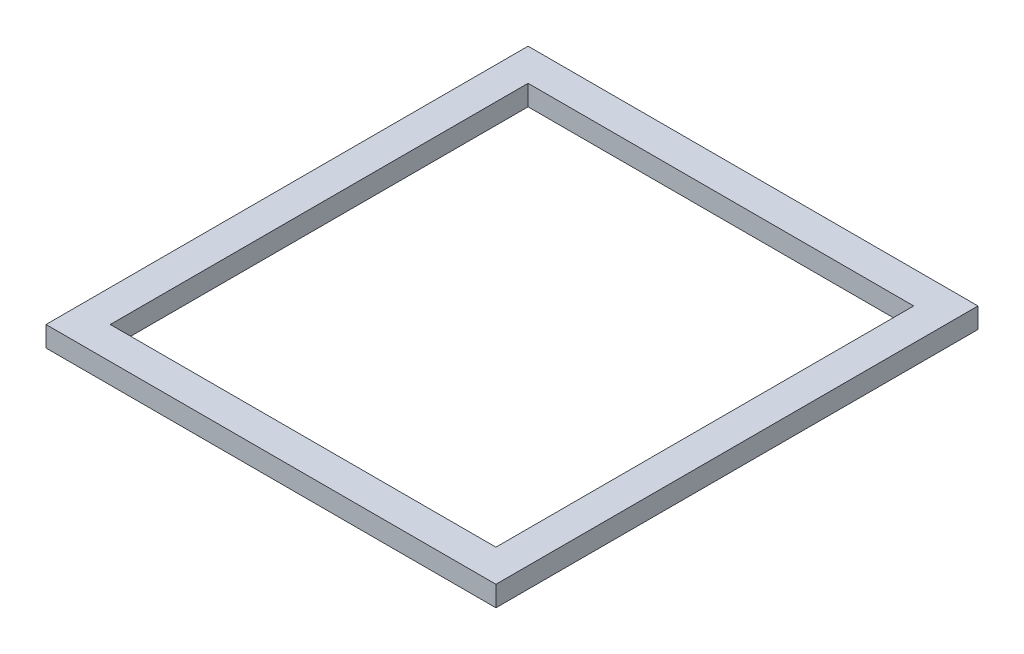
ISO-10303-21;
HEADER;
FILE_DESCRIPTION(('STEP AP214'),'2;1');
FILE_NAME('part.step','',(''),(''),'','','');
FILE_SCHEMA(('AUTOMOTIVE_DESIGN { 1 0 10303 214 1 1 1 1 }'));
ENDSEC;
DATA;
#1=APPLICATION_CONTEXT('core data for automotive mechanical design processes');
#2=APPLICATION_PROTOCOL_DEFINITION('international standard','automotive_design',2000,#1);
#3=PRODUCT_CONTEXT('',#1,'mechanical');
#4=PRODUCT('Part','Part','',(#3));
#5=PRODUCT_RELATED_PRODUCT_CATEGORY('part','',(#4));
#6=PRODUCT_DEFINITION_FORMATION('','',#4);
#7=PRODUCT_DEFINITION_CONTEXT('part definition',#1,'design');
#8=PRODUCT_DEFINITION('design','',#6,#7);
#9=PRODUCT_DEFINITION_SHAPE('','',#8);
#10=(LENGTH_UNIT() NAMED_UNIT(*) SI_UNIT(.MILLI.,.METRE.));
#11=(NAMED_UNIT(*) PLANE_ANGLE_UNIT() SI_UNIT($,.RADIAN.));
#12=(NAMED_UNIT(*) SI_UNIT($,.STERADIAN.) SOLID_ANGLE_UNIT());
#13=UNCERTAINTY_MEASURE_WITH_UNIT(LENGTH_MEASURE(1.E-05),#10,'distance_accuracy_value','');
#14=(GEOMETRIC_REPRESENTATION_CONTEXT(3) GLOBAL_UNCERTAINTY_ASSIGNED_CONTEXT((#13)) GLOBAL_UNIT_ASSIGNED_CONTEXT((#10,
#11,#12)) REPRESENTATION_CONTEXT('',''));
#15=CARTESIAN_POINT('',(0.,0.,0.));
#16=DIRECTION('',(0.,0.,1.));
#17=DIRECTION('',(1.,0.,0.));
#18=AXIS2_PLACEMENT_3D('',#15,#16,#17);
#19=CARTESIAN_POINT('',(0.,6.35,0.));
#20=DIRECTION('',(0.,1.,0.));
#21=DIRECTION('',(0.,0.,1.));
#22=AXIS2_PLACEMENT_3D('',#19,#20,#21);
#23=PLANE('',#22);
#24=DIRECTION('',(0.,0.,1.));
#25=VECTOR('',#24,1.);
#26=CARTESIAN_POINT('',(-9.99999999999999,6.35,-140.));
#27=LINE('',#26,#25);
#28=CARTESIAN_POINT('',(-9.99999999999999,6.35,-140.));
#29=VERTEX_POINT('',#28);
#30=CARTESIAN_POINT('',(-9.99999999999999,6.35,9.99999999999998));
#31=VERTEX_POINT('',#30);
#32=EDGE_CURVE('E159',#29,#31,#27,.T.);
#33=ORIENTED_EDGE('',*,*,#32,.T.);
#34=DIRECTION('',(1.,0.,0.));
#35=VECTOR('',#34,1.);
#36=CARTESIAN_POINT('',(-9.99999999999999,6.35,9.99999999999998));
#37=LINE('',#36,#35);
#38=CARTESIAN_POINT('',(130.,6.35,10.));
#39=VERTEX_POINT('',#38);
#40=EDGE_CURVE('E163',#31,#39,#37,.T.);
#41=ORIENTED_EDGE('',*,*,#40,.T.);
#42=DIRECTION('',(0.,0.,-1.));
#43=VECTOR('',#42,1.);
#44=CARTESIAN_POINT('',(130.,6.35,-140.));
#45=LINE('',#44,#43);
#46=CARTESIAN_POINT('',(130.,6.35,-140.));
#47=VERTEX_POINT('',#46);
#48=EDGE_CURVE('E167',#39,#47,#45,.T.);
#49=ORIENTED_EDGE('',*,*,#48,.T.);
#50=DIRECTION('',(-1.,0.,0.));
#51=VECTOR('',#50,1.);
#52=CARTESIAN_POINT('',(-9.99999999999999,6.35,-140.));
#53=LINE('',#52,#51);
#54=EDGE_CURVE('E170',#47,#29,#53,.T.);
#55=ORIENTED_EDGE('',*,*,#54,.T.);
#56=EDGE_LOOP('',(#33,#41,#49,#55));
#57=FACE_BOUND('',#56,.T.);
#58=DIRECTION('',(1.,0.,0.));
#59=VECTOR('',#58,1.);
#60=CARTESIAN_POINT('',(0.,6.35,0.));
#61=LINE('',#60,#59);
#62=CARTESIAN_POINT('',(0.,6.35,0.));
#63=VERTEX_POINT('',#62);
#64=CARTESIAN_POINT('',(120.,6.35,0.));
#65=VERTEX_POINT('',#64);
#66=EDGE_CURVE('E120',#63,#65,#61,.T.);
#67=ORIENTED_EDGE('',*,*,#66,.F.);
#68=DIRECTION('',(0.,0.,1.));
#69=VECTOR('',#68,1.);
#70=CARTESIAN_POINT('',(0.,6.35,0.));
#71=LINE('',#70,#69);
#72=CARTESIAN_POINT('',(0.,6.35,-130.));
#73=VERTEX_POINT('',#72);
#74=EDGE_CURVE('E111',#73,#63,#71,.T.);
#75=ORIENTED_EDGE('',*,*,#74,.F.);
#76=DIRECTION('',(-1.,0.,0.));
#77=VECTOR('',#76,1.);
#78=CARTESIAN_POINT('',(0.,6.35,-130.));
#79=LINE('',#78,#77);
#80=CARTESIAN_POINT('',(120.,6.35,-130.));
#81=VERTEX_POINT('',#80);
#82=EDGE_CURVE('E137',#81,#73,#79,.T.);
#83=ORIENTED_EDGE('',*,*,#82,.F.);
#84=DIRECTION('',(0.,0.,-1.));
#85=VECTOR('',#84,1.);
#86=CARTESIAN_POINT('',(120.,6.35,0.));
#87=LINE('',#86,#85);
#88=EDGE_CURVE('E133',#65,#81,#87,.T.);
#89=ORIENTED_EDGE('',*,*,#88,.F.);
#90=EDGE_LOOP('',(#67,#75,#83,#89));
#91=FACE_BOUND('',#90,.T.);
#92=ADVANCED_FACE('F45',(#57,#91),#23,.T.);
#93=CARTESIAN_POINT('',(0.,0.,0.));
#94=DIRECTION('',(0.,1.,0.));
#95=DIRECTION('',(0.,0.,1.));
#96=AXIS2_PLACEMENT_3D('',#93,#94,#95);
#97=PLANE('',#96);
#98=DIRECTION('',(0.,0.,1.));
#99=VECTOR('',#98,1.);
#100=CARTESIAN_POINT('',(-9.99999999999999,0.,-140.));
#101=LINE('',#100,#99);
#102=CARTESIAN_POINT('',(-9.99999999999999,0.,-140.));
#103=VERTEX_POINT('',#102);
#104=CARTESIAN_POINT('',(-9.99999999999999,0.,9.99999999999998));
#105=VERTEX_POINT('',#104);
#106=EDGE_CURVE('E129',#103,#105,#101,.T.);
#107=ORIENTED_EDGE('',*,*,#106,.F.);
#108=DIRECTION('',(-1.,0.,0.));
#109=VECTOR('',#108,1.);
#110=CARTESIAN_POINT('',(-9.99999999999999,0.,-140.));
#111=LINE('',#110,#109);
#112=CARTESIAN_POINT('',(130.,0.,-140.));
#113=VERTEX_POINT('',#112);
#114=EDGE_CURVE('E164',#113,#103,#111,.T.);
#115=ORIENTED_EDGE('',*,*,#114,.F.);
#116=DIRECTION('',(0.,0.,-1.));
#117=VECTOR('',#116,1.);
#118=CARTESIAN_POINT('',(130.,0.,-140.));
#119=LINE('',#118,#117);
#120=CARTESIAN_POINT('',(130.,0.,10.));
#121=VERTEX_POINT('',#120);
#122=EDGE_CURVE('E180',#121,#113,#119,.T.);
#123=ORIENTED_EDGE('',*,*,#122,.F.);
#124=DIRECTION('',(1.,0.,0.));
#125=VECTOR('',#124,1.);
#126=CARTESIAN_POINT('',(-9.99999999999999,0.,9.99999999999998));
#127=LINE('',#126,#125);
#128=EDGE_CURVE('E177',#105,#121,#127,.T.);
#129=ORIENTED_EDGE('',*,*,#128,.F.);
#130=EDGE_LOOP('',(#107,#115,#123,#129));
#131=FACE_BOUND('',#130,.T.);
#132=DIRECTION('',(0.,0.,1.));
#133=VECTOR('',#132,1.);
#134=CARTESIAN_POINT('',(0.,0.,0.));
#135=LINE('',#134,#133);
#136=CARTESIAN_POINT('',(0.,0.,-130.));
#137=VERTEX_POINT('',#136);
#138=CARTESIAN_POINT('',(0.,0.,0.));
#139=VERTEX_POINT('',#138);
#140=EDGE_CURVE('E69',#137,#139,#135,.T.);
#141=ORIENTED_EDGE('',*,*,#140,.T.);
#142=DIRECTION('',(1.,0.,0.));
#143=VECTOR('',#142,1.);
#144=CARTESIAN_POINT('',(0.,0.,0.));
#145=LINE('',#144,#143);
#146=CARTESIAN_POINT('',(120.,0.,0.));
#147=VERTEX_POINT('',#146);
#148=EDGE_CURVE('E127',#139,#147,#145,.T.);
#149=ORIENTED_EDGE('',*,*,#148,.T.);
#150=DIRECTION('',(0.,0.,-1.));
#151=VECTOR('',#150,1.);
#152=CARTESIAN_POINT('',(120.,0.,0.));
#153=LINE('',#152,#151);
#154=CARTESIAN_POINT('',(120.,0.,-130.));
#155=VERTEX_POINT('',#154);
#156=EDGE_CURVE('E146',#147,#155,#153,.T.);
#157=ORIENTED_EDGE('',*,*,#156,.T.);
#158=DIRECTION('',(-1.,0.,0.));
#159=VECTOR('',#158,1.);
#160=CARTESIAN_POINT('',(0.,0.,-130.));
#161=LINE('',#160,#159);
#162=EDGE_CURVE('E121',#155,#137,#161,.T.);
#163=ORIENTED_EDGE('',*,*,#162,.T.);
#164=EDGE_LOOP('',(#141,#149,#157,#163));
#165=FACE_BOUND('',#164,.T.);
#166=ADVANCED_FACE('F203',(#131,#165),#97,.F.);
#167=CARTESIAN_POINT('',(-9.99999999999999,6.35,-140.));
#168=DIRECTION('',(1.,0.,0.));
#169=DIRECTION('',(0.,0.,-1.));
#170=AXIS2_PLACEMENT_3D('',#167,#168,#169);
#171=PLANE('',#170);
#172=ORIENTED_EDGE('',*,*,#106,.T.);
#173=DIRECTION('',(0.,-1.,0.));
#174=VECTOR('',#173,1.);
#175=CARTESIAN_POINT('',(-9.99999999999999,6.35,9.99999999999998));
#176=LINE('',#175,#174);
#177=EDGE_CURVE('E11',#31,#105,#176,.T.);
#178=ORIENTED_EDGE('',*,*,#177,.F.);
#179=ORIENTED_EDGE('',*,*,#32,.F.);
#180=DIRECTION('',(0.,-1.,0.));
#181=VECTOR('',#180,1.);
#182=CARTESIAN_POINT('',(-9.99999999999999,6.35,-140.));
#183=LINE('',#182,#181);
#184=EDGE_CURVE('E173',#29,#103,#183,.T.);
#185=ORIENTED_EDGE('',*,*,#184,.T.);
#186=EDGE_LOOP('',(#172,#178,#179,#185));
#187=FACE_BOUND('',#186,.T.);
#188=ADVANCED_FACE('F47',(#187),#171,.F.);
#189=CARTESIAN_POINT('',(-9.99999999999999,6.35,9.99999999999998));
#190=DIRECTION('',(0.,0.,-1.));
#191=DIRECTION('',(-1.,0.,0.));
#192=AXIS2_PLACEMENT_3D('',#189,#190,#191);
#193=PLANE('',#192);
#194=ORIENTED_EDGE('',*,*,#128,.T.);
#195=DIRECTION('',(0.,-1.,0.));
#196=VECTOR('',#195,1.);
#197=CARTESIAN_POINT('',(130.,6.35,10.));
#198=LINE('',#197,#196);
#199=EDGE_CURVE('E54',#39,#121,#198,.T.);
#200=ORIENTED_EDGE('',*,*,#199,.F.);
#201=ORIENTED_EDGE('',*,*,#40,.F.);
#202=ORIENTED_EDGE('',*,*,#177,.T.);
#203=EDGE_LOOP('',(#194,#200,#201,#202));
#204=FACE_BOUND('',#203,.T.);
#205=ADVANCED_FACE('F213',(#204),#193,.F.);
#206=CARTESIAN_POINT('',(130.,6.35,-140.));
#207=DIRECTION('',(-1.,0.,0.));
#208=DIRECTION('',(0.,0.,1.));
#209=AXIS2_PLACEMENT_3D('',#206,#207,#208);
#210=PLANE('',#209);
#211=ORIENTED_EDGE('',*,*,#122,.T.);
#212=DIRECTION('',(0.,-1.,0.));
#213=VECTOR('',#212,1.);
#214=CARTESIAN_POINT('',(130.,6.35,-140.));
#215=LINE('',#214,#213);
#216=EDGE_CURVE('E188',#47,#113,#215,.T.);
#217=ORIENTED_EDGE('',*,*,#216,.F.);
#218=ORIENTED_EDGE('',*,*,#48,.F.);
#219=ORIENTED_EDGE('',*,*,#199,.T.);
#220=EDGE_LOOP('',(#211,#217,#218,#219));
#221=FACE_BOUND('',#220,.T.);
#222=ADVANCED_FACE('F197',(#221),#210,.F.);
#223=CARTESIAN_POINT('',(-9.99999999999999,6.35,-140.));
#224=DIRECTION('',(0.,0.,1.));
#225=DIRECTION('',(1.,0.,0.));
#226=AXIS2_PLACEMENT_3D('',#223,#224,#225);
#227=PLANE('',#226);
#228=ORIENTED_EDGE('',*,*,#114,.T.);
#229=ORIENTED_EDGE('',*,*,#184,.F.);
#230=ORIENTED_EDGE('',*,*,#54,.F.);
#231=ORIENTED_EDGE('',*,*,#216,.T.);
#232=EDGE_LOOP('',(#228,#229,#230,#231));
#233=FACE_BOUND('',#232,.T.);
#234=ADVANCED_FACE('F207',(#233),#227,.F.);
#235=CARTESIAN_POINT('',(0.,6.35,0.));
#236=DIRECTION('',(1.,0.,0.));
#237=DIRECTION('',(0.,0.,-1.));
#238=AXIS2_PLACEMENT_3D('',#235,#236,#237);
#239=PLANE('',#238);
#240=ORIENTED_EDGE('',*,*,#140,.F.);
#241=DIRECTION('',(0.,-1.,0.));
#242=VECTOR('',#241,1.);
#243=CARTESIAN_POINT('',(0.,6.35,-130.));
#244=LINE('',#243,#242);
#245=EDGE_CURVE('E115',#73,#137,#244,.T.);
#246=ORIENTED_EDGE('',*,*,#245,.F.);
#247=ORIENTED_EDGE('',*,*,#74,.T.);
#248=DIRECTION('',(0.,-1.,0.));
#249=VECTOR('',#248,1.);
#250=CARTESIAN_POINT('',(0.,6.35,0.));
#251=LINE('',#250,#249);
#252=EDGE_CURVE('E114',#63,#139,#251,.T.);
#253=ORIENTED_EDGE('',*,*,#252,.T.);
#254=EDGE_LOOP('',(#240,#246,#247,#253));
#255=FACE_BOUND('',#254,.T.);
#256=ADVANCED_FACE('F113',(#255),#239,.T.);
#257=CARTESIAN_POINT('',(0.,6.35,0.));
#258=DIRECTION('',(0.,0.,-1.));
#259=DIRECTION('',(-1.,0.,0.));
#260=AXIS2_PLACEMENT_3D('',#257,#258,#259);
#261=PLANE('',#260);
#262=ORIENTED_EDGE('',*,*,#148,.F.);
#263=ORIENTED_EDGE('',*,*,#252,.F.);
#264=ORIENTED_EDGE('',*,*,#66,.T.);
#265=DIRECTION('',(0.,-1.,0.));
#266=VECTOR('',#265,1.);
#267=CARTESIAN_POINT('',(120.,6.35,0.));
#268=LINE('',#267,#266);
#269=EDGE_CURVE('E130',#65,#147,#268,.T.);
#270=ORIENTED_EDGE('',*,*,#269,.T.);
#271=EDGE_LOOP('',(#262,#263,#264,#270));
#272=FACE_BOUND('',#271,.T.);
#273=ADVANCED_FACE('F124',(#272),#261,.T.);
#274=CARTESIAN_POINT('',(120.,6.35,0.));
#275=DIRECTION('',(-1.,0.,0.));
#276=DIRECTION('',(0.,0.,1.));
#277=AXIS2_PLACEMENT_3D('',#274,#275,#276);
#278=PLANE('',#277);
#279=ORIENTED_EDGE('',*,*,#156,.F.);
#280=ORIENTED_EDGE('',*,*,#269,.F.);
#281=ORIENTED_EDGE('',*,*,#88,.T.);
#282=DIRECTION('',(0.,-1.,0.));
#283=VECTOR('',#282,1.);
#284=CARTESIAN_POINT('',(120.,6.35,-130.));
#285=LINE('',#284,#283);
#286=EDGE_CURVE('E61',#81,#155,#285,.T.);
#287=ORIENTED_EDGE('',*,*,#286,.T.);
#288=EDGE_LOOP('',(#279,#280,#281,#287));
#289=FACE_BOUND('',#288,.T.);
#290=ADVANCED_FACE('F236',(#289),#278,.T.);
#291=CARTESIAN_POINT('',(0.,6.35,-130.));
#292=DIRECTION('',(0.,0.,1.));
#293=DIRECTION('',(1.,0.,0.));
#294=AXIS2_PLACEMENT_3D('',#291,#292,#293);
#295=PLANE('',#294);
#296=ORIENTED_EDGE('',*,*,#162,.F.);
#297=ORIENTED_EDGE('',*,*,#286,.F.);
#298=ORIENTED_EDGE('',*,*,#82,.T.);
#299=ORIENTED_EDGE('',*,*,#245,.T.);
#300=EDGE_LOOP('',(#296,#297,#298,#299));
#301=FACE_BOUND('',#300,.T.);
#302=ADVANCED_FACE('F240',(#301),#295,.T.);
#303=CLOSED_SHELL('',(#92,#166,#188,#205,#222,#234,#256,#273,#290,#302));
#304=MANIFOLD_SOLID_BREP('B2',#303);
#305=ADVANCED_BREP_SHAPE_REPRESENTATION('',(#18,#304),#14);
#306=SHAPE_DEFINITION_REPRESENTATION(#9,#305);
ENDSEC;
END-ISO-10303-21;
